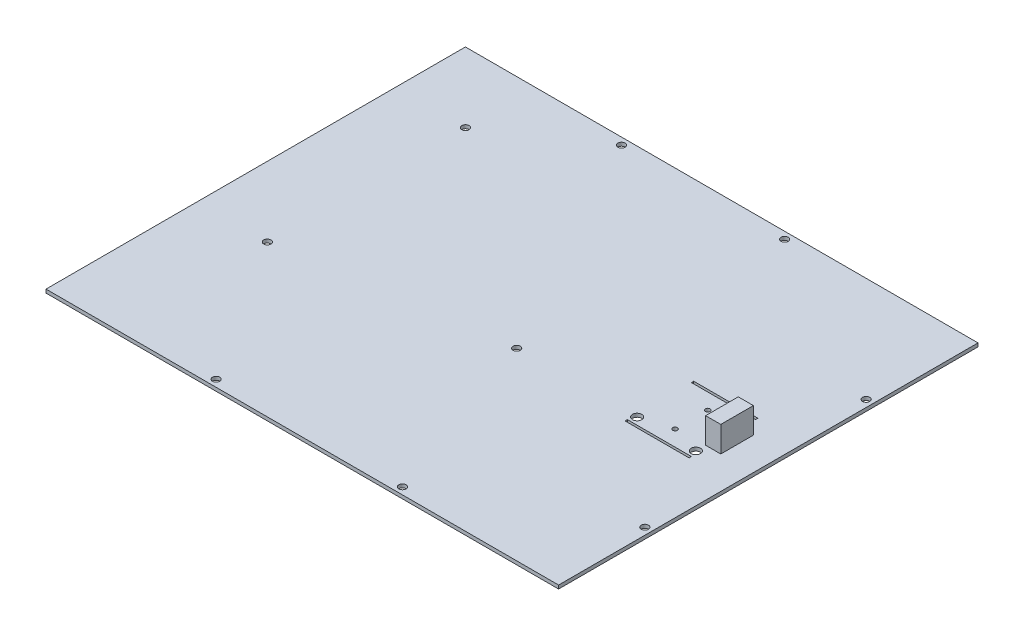
ISO-10303-21;
HEADER;
FILE_DESCRIPTION(('STEP AP214'),'2;1');
FILE_NAME('part.step','',(''),(''),'','','');
FILE_SCHEMA(('AUTOMOTIVE_DESIGN { 1 0 10303 214 1 1 1 1 }'));
ENDSEC;
DATA;
#1=APPLICATION_CONTEXT('core data for automotive mechanical design processes');
#2=APPLICATION_PROTOCOL_DEFINITION('international standard','automotive_design',2000,#1);
#3=PRODUCT_CONTEXT('',#1,'mechanical');
#4=PRODUCT('Part','Part','',(#3));
#5=PRODUCT_RELATED_PRODUCT_CATEGORY('part','',(#4));
#6=PRODUCT_DEFINITION_FORMATION('','',#4);
#7=PRODUCT_DEFINITION_CONTEXT('part definition',#1,'design');
#8=PRODUCT_DEFINITION('design','',#6,#7);
#9=PRODUCT_DEFINITION_SHAPE('','',#8);
#10=(LENGTH_UNIT() NAMED_UNIT(*) SI_UNIT(.MILLI.,.METRE.));
#11=(NAMED_UNIT(*) PLANE_ANGLE_UNIT() SI_UNIT($,.RADIAN.));
#12=(NAMED_UNIT(*) SI_UNIT($,.STERADIAN.) SOLID_ANGLE_UNIT());
#13=UNCERTAINTY_MEASURE_WITH_UNIT(LENGTH_MEASURE(1.E-05),#10,'distance_accuracy_value','');
#14=(GEOMETRIC_REPRESENTATION_CONTEXT(3) GLOBAL_UNCERTAINTY_ASSIGNED_CONTEXT((#13)) GLOBAL_UNIT_ASSIGNED_CONTEXT((#10,
#11,#12)) REPRESENTATION_CONTEXT('',''));
#15=CARTESIAN_POINT('',(0.,0.,0.));
#16=DIRECTION('',(0.,0.,1.));
#17=DIRECTION('',(1.,0.,0.));
#18=AXIS2_PLACEMENT_3D('',#15,#16,#17);
#19=CARTESIAN_POINT('',(0.,1.5,0.));
#20=DIRECTION('',(0.,-1.,0.));
#21=DIRECTION('',(0.,0.,-1.));
#22=AXIS2_PLACEMENT_3D('',#19,#20,#21);
#23=PLANE('',#22);
#24=CARTESIAN_POINT('',(123.,1.5,-79.));
#25=DIRECTION('',(0.,1.,0.));
#26=DIRECTION('',(0.,0.,1.));
#27=AXIS2_PLACEMENT_3D('',#24,#25,#26);
#28=CIRCLE('',#27,1.54999999999999);
#29=CARTESIAN_POINT('',(123.,1.5,-77.45));
#30=VERTEX_POINT('',#29);
#31=EDGE_CURVE('E267',#30,#30,#28,.T.);
#32=ORIENTED_EDGE('',*,*,#31,.F.);
#33=EDGE_LOOP('',(#32));
#34=FACE_BOUND('',#33,.T.);
#35=CARTESIAN_POINT('',(217.,1.5,-135.));
#36=DIRECTION('',(0.,1.,0.));
#37=DIRECTION('',(0.,0.,1.));
#38=AXIS2_PLACEMENT_3D('',#35,#36,#37);
#39=CIRCLE('',#38,1.54999999999999);
#40=CARTESIAN_POINT('',(217.,1.5,-133.45));
#41=VERTEX_POINT('',#40);
#42=EDGE_CURVE('E273',#41,#41,#39,.T.);
#43=ORIENTED_EDGE('',*,*,#42,.F.);
#44=EDGE_LOOP('',(#43));
#45=FACE_BOUND('',#44,.T.);
#46=CARTESIAN_POINT('',(150.,1.5,-3.));
#47=DIRECTION('',(0.,1.,0.));
#48=DIRECTION('',(0.,0.,1.));
#49=AXIS2_PLACEMENT_3D('',#46,#47,#48);
#50=CIRCLE('',#49,1.54999999999999);
#51=CARTESIAN_POINT('',(150.,1.5,-1.45000000000001));
#52=VERTEX_POINT('',#51);
#53=EDGE_CURVE('E279',#52,#52,#50,.T.);
#54=ORIENTED_EDGE('',*,*,#53,.F.);
#55=EDGE_LOOP('',(#54));
#56=FACE_BOUND('',#55,.T.);
#57=CARTESIAN_POINT('',(70.,1.5,-3.));
#58=DIRECTION('',(0.,1.,0.));
#59=DIRECTION('',(0.,0.,1.));
#60=AXIS2_PLACEMENT_3D('',#57,#58,#59);
#61=CIRCLE('',#60,1.54999999999999);
#62=CARTESIAN_POINT('',(70.,1.5,-1.45000000000001));
#63=VERTEX_POINT('',#62);
#64=EDGE_CURVE('E285',#63,#63,#61,.T.);
#65=ORIENTED_EDGE('',*,*,#64,.F.);
#66=EDGE_LOOP('',(#65));
#67=FACE_BOUND('',#66,.T.);
#68=CARTESIAN_POINT('',(217.,1.5,-40.));
#69=DIRECTION('',(0.,1.,0.));
#70=DIRECTION('',(0.,0.,1.));
#71=AXIS2_PLACEMENT_3D('',#68,#69,#70);
#72=CIRCLE('',#71,1.54999999999999);
#73=CARTESIAN_POINT('',(217.,1.5,-38.45));
#74=VERTEX_POINT('',#73);
#75=EDGE_CURVE('E291',#74,#74,#72,.T.);
#76=ORIENTED_EDGE('',*,*,#75,.F.);
#77=EDGE_LOOP('',(#76));
#78=FACE_BOUND('',#77,.T.);
#79=CARTESIAN_POINT('',(30.,1.5,-65.));
#80=DIRECTION('',(0.,1.,0.));
#81=DIRECTION('',(0.,0.,1.));
#82=AXIS2_PLACEMENT_3D('',#79,#80,#81);
#83=CIRCLE('',#82,1.55);
#84=CARTESIAN_POINT('',(30.,1.5,-63.45));
#85=VERTEX_POINT('',#84);
#86=EDGE_CURVE('E297',#85,#85,#83,.T.);
#87=ORIENTED_EDGE('',*,*,#86,.F.);
#88=EDGE_LOOP('',(#87));
#89=FACE_BOUND('',#88,.T.);
#90=CARTESIAN_POINT('',(30.,1.5,-150.));
#91=DIRECTION('',(0.,1.,0.));
#92=DIRECTION('',(0.,0.,1.));
#93=AXIS2_PLACEMENT_3D('',#90,#91,#92);
#94=CIRCLE('',#93,1.54999999999999);
#95=CARTESIAN_POINT('',(30.,1.5,-148.45));
#96=VERTEX_POINT('',#95);
#97=EDGE_CURVE('E303',#96,#96,#94,.T.);
#98=ORIENTED_EDGE('',*,*,#97,.F.);
#99=EDGE_LOOP('',(#98));
#100=FACE_BOUND('',#99,.T.);
#101=CARTESIAN_POINT('',(140.,1.5,-177.));
#102=DIRECTION('',(0.,1.,0.));
#103=DIRECTION('',(0.,0.,1.));
#104=AXIS2_PLACEMENT_3D('',#101,#102,#103);
#105=CIRCLE('',#104,1.54999999999999);
#106=CARTESIAN_POINT('',(140.,1.5,-175.45));
#107=VERTEX_POINT('',#106);
#108=EDGE_CURVE('E309',#107,#107,#105,.T.);
#109=ORIENTED_EDGE('',*,*,#108,.F.);
#110=EDGE_LOOP('',(#109));
#111=FACE_BOUND('',#110,.T.);
#112=CARTESIAN_POINT('',(70.,1.5,-177.));
#113=DIRECTION('',(0.,1.,0.));
#114=DIRECTION('',(0.,0.,1.));
#115=AXIS2_PLACEMENT_3D('',#112,#113,#114);
#116=CIRCLE('',#115,1.54999999999999);
#117=CARTESIAN_POINT('',(70.,1.5,-175.45));
#118=VERTEX_POINT('',#117);
#119=EDGE_CURVE('E315',#118,#118,#116,.T.);
#120=ORIENTED_EDGE('',*,*,#119,.F.);
#121=EDGE_LOOP('',(#120));
#122=FACE_BOUND('',#121,.T.);
#123=DIRECTION('',(0.,0.,1.));
#124=VECTOR('',#123,1.);
#125=CARTESIAN_POINT('',(0.,1.5,0.));
#126=LINE('',#125,#124);
#127=CARTESIAN_POINT('',(0.,1.5,-180.));
#128=VERTEX_POINT('',#127);
#129=CARTESIAN_POINT('',(0.,1.5,0.));
#130=VERTEX_POINT('',#129);
#131=EDGE_CURVE('E321',#128,#130,#126,.T.);
#132=ORIENTED_EDGE('',*,*,#131,.T.);
#133=DIRECTION('',(1.,0.,0.));
#134=VECTOR('',#133,1.);
#135=CARTESIAN_POINT('',(0.,1.5,0.));
#136=LINE('',#135,#134);
#137=CARTESIAN_POINT('',(220.,1.5,0.));
#138=VERTEX_POINT('',#137);
#139=EDGE_CURVE('E324',#130,#138,#136,.T.);
#140=ORIENTED_EDGE('',*,*,#139,.T.);
#141=DIRECTION('',(0.,0.,-1.));
#142=VECTOR('',#141,1.);
#143=CARTESIAN_POINT('',(220.,1.5,0.));
#144=LINE('',#143,#142);
#145=CARTESIAN_POINT('',(220.,1.5,-180.));
#146=VERTEX_POINT('',#145);
#147=EDGE_CURVE('E327',#138,#146,#144,.T.);
#148=ORIENTED_EDGE('',*,*,#147,.T.);
#149=DIRECTION('',(-1.,0.,0.));
#150=VECTOR('',#149,1.);
#151=CARTESIAN_POINT('',(0.,1.5,-180.));
#152=LINE('',#151,#150);
#153=EDGE_CURVE('E329',#146,#128,#152,.T.);
#154=ORIENTED_EDGE('',*,*,#153,.T.);
#155=EDGE_LOOP('',(#132,#140,#148,#154));
#156=FACE_BOUND('',#155,.T.);
#157=DIRECTION('',(0.,0.,-1.));
#158=VECTOR('',#157,1.);
#159=CARTESIAN_POINT('',(200.75,1.5,-75.25));
#160=LINE('',#159,#158);
#161=CARTESIAN_POINT('',(200.75,1.5,-75.25));
#162=VERTEX_POINT('',#161);
#163=CARTESIAN_POINT('',(200.75,1.5,-76.25));
#164=VERTEX_POINT('',#163);
#165=EDGE_CURVE('E250',#162,#164,#160,.T.);
#166=ORIENTED_EDGE('',*,*,#165,.F.);
#167=DIRECTION('',(1.,0.,0.));
#168=VECTOR('',#167,1.);
#169=CARTESIAN_POINT('',(173.25,1.5,-75.25));
#170=LINE('',#169,#168);
#171=CARTESIAN_POINT('',(173.25,1.5,-75.25));
#172=VERTEX_POINT('',#171);
#173=EDGE_CURVE('E228',#172,#162,#170,.T.);
#174=ORIENTED_EDGE('',*,*,#173,.F.);
#175=DIRECTION('',(0.,0.,1.));
#176=VECTOR('',#175,1.);
#177=CARTESIAN_POINT('',(173.25,1.5,-75.25));
#178=LINE('',#177,#176);
#179=CARTESIAN_POINT('',(173.25,1.5,-76.25));
#180=VERTEX_POINT('',#179);
#181=EDGE_CURVE('E239',#180,#172,#178,.T.);
#182=ORIENTED_EDGE('',*,*,#181,.F.);
#183=DIRECTION('',(-1.,0.,0.));
#184=VECTOR('',#183,1.);
#185=CARTESIAN_POINT('',(173.25,1.5,-76.25));
#186=LINE('',#185,#184);
#187=EDGE_CURVE('E253',#164,#180,#186,.T.);
#188=ORIENTED_EDGE('',*,*,#187,.F.);
#189=EDGE_LOOP('',(#166,#174,#182,#188));
#190=FACE_BOUND('',#189,.T.);
#191=DIRECTION('',(0.,0.,1.));
#192=VECTOR('',#191,1.);
#193=CARTESIAN_POINT('',(173.25,1.5,-104.75));
#194=LINE('',#193,#192);
#195=CARTESIAN_POINT('',(173.25,1.5,-104.75));
#196=VERTEX_POINT('',#195);
#197=CARTESIAN_POINT('',(173.25,1.5,-103.75));
#198=VERTEX_POINT('',#197);
#199=EDGE_CURVE('E218',#196,#198,#194,.T.);
#200=ORIENTED_EDGE('',*,*,#199,.F.);
#201=DIRECTION('',(-1.,0.,0.));
#202=VECTOR('',#201,1.);
#203=CARTESIAN_POINT('',(173.25,1.5,-104.75));
#204=LINE('',#203,#202);
#205=CARTESIAN_POINT('',(200.75,1.5,-104.75));
#206=VERTEX_POINT('',#205);
#207=EDGE_CURVE('E200',#206,#196,#204,.T.);
#208=ORIENTED_EDGE('',*,*,#207,.F.);
#209=DIRECTION('',(0.,0.,-1.));
#210=VECTOR('',#209,1.);
#211=CARTESIAN_POINT('',(200.75,1.5,-104.75));
#212=LINE('',#211,#210);
#213=CARTESIAN_POINT('',(200.75,1.5,-103.75));
#214=VERTEX_POINT('',#213);
#215=EDGE_CURVE('E207',#214,#206,#212,.T.);
#216=ORIENTED_EDGE('',*,*,#215,.F.);
#217=DIRECTION('',(1.,0.,0.));
#218=VECTOR('',#217,1.);
#219=CARTESIAN_POINT('',(173.25,1.5,-103.75));
#220=LINE('',#219,#218);
#221=EDGE_CURVE('E221',#198,#214,#220,.T.);
#222=ORIENTED_EDGE('',*,*,#221,.F.);
#223=EDGE_LOOP('',(#200,#208,#216,#222));
#224=FACE_BOUND('',#223,.T.);
#225=CARTESIAN_POINT('',(187.,1.5,-83.));
#226=DIRECTION('',(0.,1.,0.));
#227=DIRECTION('',(0.,0.,1.));
#228=AXIS2_PLACEMENT_3D('',#225,#226,#227);
#229=CIRCLE('',#228,0.999999999999998);
#230=CARTESIAN_POINT('',(187.,1.5,-82.));
#231=VERTEX_POINT('',#230);
#232=EDGE_CURVE('E194',#231,#231,#229,.T.);
#233=ORIENTED_EDGE('',*,*,#232,.F.);
#234=EDGE_LOOP('',(#233));
#235=FACE_BOUND('',#234,.T.);
#236=CARTESIAN_POINT('',(187.,1.5,-97.));
#237=DIRECTION('',(0.,1.,0.));
#238=DIRECTION('',(0.,0.,-1.));
#239=AXIS2_PLACEMENT_3D('',#236,#237,#238);
#240=CIRCLE('',#239,0.999999999999998);
#241=CARTESIAN_POINT('',(187.,1.5,-98.));
#242=VERTEX_POINT('',#241);
#243=EDGE_CURVE('E188',#242,#242,#240,.T.);
#244=ORIENTED_EDGE('',*,*,#243,.F.);
#245=EDGE_LOOP('',(#244));
#246=FACE_BOUND('',#245,.T.);
#247=CARTESIAN_POINT('',(174.4,1.5,-79.3));
#248=DIRECTION('',(0.,1.,0.));
#249=DIRECTION('',(0.,0.,1.));
#250=AXIS2_PLACEMENT_3D('',#247,#248,#249);
#251=CIRCLE('',#250,2.);
#252=CARTESIAN_POINT('',(174.4,1.5,-77.3));
#253=VERTEX_POINT('',#252);
#254=EDGE_CURVE('E182',#253,#253,#251,.T.);
#255=ORIENTED_EDGE('',*,*,#254,.F.);
#256=EDGE_LOOP('',(#255));
#257=FACE_BOUND('',#256,.T.);
#258=CARTESIAN_POINT('',(199.6,1.5,-79.3));
#259=DIRECTION('',(0.,1.,0.));
#260=DIRECTION('',(0.,0.,1.));
#261=AXIS2_PLACEMENT_3D('',#258,#259,#260);
#262=CIRCLE('',#261,2.);
#263=CARTESIAN_POINT('',(199.6,1.5,-77.3));
#264=VERTEX_POINT('',#263);
#265=EDGE_CURVE('E177',#264,#264,#262,.T.);
#266=ORIENTED_EDGE('',*,*,#265,.F.);
#267=EDGE_LOOP('',(#266));
#268=FACE_BOUND('',#267,.T.);
#269=CARTESIAN_POINT('',(199.6,1.5,-100.7));
#270=DIRECTION('',(0.,1.,0.));
#271=DIRECTION('',(0.,0.,-1.));
#272=AXIS2_PLACEMENT_3D('',#269,#270,#271);
#273=CIRCLE('',#272,2.);
#274=CARTESIAN_POINT('',(199.6,1.5,-102.7));
#275=VERTEX_POINT('',#274);
#276=EDGE_CURVE('E167',#275,#275,#273,.T.);
#277=ORIENTED_EDGE('',*,*,#276,.F.);
#278=EDGE_LOOP('',(#277));
#279=FACE_BOUND('',#278,.T.);
#280=DIRECTION('',(1.,0.,0.));
#281=VECTOR('',#280,1.);
#282=CARTESIAN_POINT('',(199.6,1.5,-83.5));
#283=LINE('',#282,#281);
#284=CARTESIAN_POINT('',(199.6,1.5,-83.5));
#285=VERTEX_POINT('',#284);
#286=CARTESIAN_POINT('',(206.1,1.5,-83.5));
#287=VERTEX_POINT('',#286);
#288=EDGE_CURVE('E166',#285,#287,#283,.T.);
#289=ORIENTED_EDGE('',*,*,#288,.F.);
#290=DIRECTION('',(0.,0.,1.));
#291=VECTOR('',#290,1.);
#292=CARTESIAN_POINT('',(199.6,1.5,-83.5));
#293=LINE('',#292,#291);
#294=CARTESIAN_POINT('',(199.6,1.5,-97.5));
#295=VERTEX_POINT('',#294);
#296=EDGE_CURVE('E163',#295,#285,#293,.T.);
#297=ORIENTED_EDGE('',*,*,#296,.F.);
#298=DIRECTION('',(-1.,0.,0.));
#299=VECTOR('',#298,1.);
#300=CARTESIAN_POINT('',(199.6,1.5,-97.5));
#301=LINE('',#300,#299);
#302=CARTESIAN_POINT('',(206.1,1.5,-97.5));
#303=VERTEX_POINT('',#302);
#304=EDGE_CURVE('E53',#303,#295,#301,.T.);
#305=ORIENTED_EDGE('',*,*,#304,.F.);
#306=DIRECTION('',(0.,0.,-1.));
#307=VECTOR('',#306,1.);
#308=CARTESIAN_POINT('',(206.1,1.5,-83.5));
#309=LINE('',#308,#307);
#310=EDGE_CURVE('E48',#287,#303,#309,.T.);
#311=ORIENTED_EDGE('',*,*,#310,.F.);
#312=EDGE_LOOP('',(#289,#297,#305,#311));
#313=FACE_BOUND('',#312,.T.);
#314=ADVANCED_FACE('F33',(#34,#45,#56,#67,#78,#89,#100,#111,#122,#156,#190,#224,#235,#246,#257,
#268,#279,#313),#23,.F.);
#315=CARTESIAN_POINT('',(0.,0.,0.));
#316=DIRECTION('',(0.,-1.,0.));
#317=DIRECTION('',(0.,0.,-1.));
#318=AXIS2_PLACEMENT_3D('',#315,#316,#317);
#319=PLANE('',#318);
#320=CARTESIAN_POINT('',(199.6,0.,-100.7));
#321=DIRECTION('',(0.,1.,0.));
#322=DIRECTION('',(0.,0.,-1.));
#323=AXIS2_PLACEMENT_3D('',#320,#321,#322);
#324=CIRCLE('',#323,2.);
#325=CARTESIAN_POINT('',(199.6,0.,-102.7));
#326=VERTEX_POINT('',#325);
#327=EDGE_CURVE('E170',#326,#326,#324,.T.);
#328=ORIENTED_EDGE('',*,*,#327,.T.);
#329=EDGE_LOOP('',(#328));
#330=FACE_BOUND('',#329,.T.);
#331=CARTESIAN_POINT('',(199.6,0.,-79.3));
#332=DIRECTION('',(0.,1.,0.));
#333=DIRECTION('',(0.,0.,1.));
#334=AXIS2_PLACEMENT_3D('',#331,#332,#333);
#335=CIRCLE('',#334,2.);
#336=CARTESIAN_POINT('',(199.6,0.,-77.3));
#337=VERTEX_POINT('',#336);
#338=EDGE_CURVE('E179',#337,#337,#335,.T.);
#339=ORIENTED_EDGE('',*,*,#338,.T.);
#340=EDGE_LOOP('',(#339));
#341=FACE_BOUND('',#340,.T.);
#342=CARTESIAN_POINT('',(174.4,0.,-79.3));
#343=DIRECTION('',(0.,1.,0.));
#344=DIRECTION('',(0.,0.,1.));
#345=AXIS2_PLACEMENT_3D('',#342,#343,#344);
#346=CIRCLE('',#345,2.);
#347=CARTESIAN_POINT('',(174.4,0.,-77.3));
#348=VERTEX_POINT('',#347);
#349=EDGE_CURVE('E185',#348,#348,#346,.T.);
#350=ORIENTED_EDGE('',*,*,#349,.T.);
#351=EDGE_LOOP('',(#350));
#352=FACE_BOUND('',#351,.T.);
#353=CARTESIAN_POINT('',(187.,0.,-97.));
#354=DIRECTION('',(0.,1.,0.));
#355=DIRECTION('',(0.,0.,-1.));
#356=AXIS2_PLACEMENT_3D('',#353,#354,#355);
#357=CIRCLE('',#356,0.999999999999998);
#358=CARTESIAN_POINT('',(187.,0.,-98.));
#359=VERTEX_POINT('',#358);
#360=EDGE_CURVE('E191',#359,#359,#357,.T.);
#361=ORIENTED_EDGE('',*,*,#360,.T.);
#362=EDGE_LOOP('',(#361));
#363=FACE_BOUND('',#362,.T.);
#364=CARTESIAN_POINT('',(187.,0.,-83.));
#365=DIRECTION('',(0.,1.,0.));
#366=DIRECTION('',(0.,0.,1.));
#367=AXIS2_PLACEMENT_3D('',#364,#365,#366);
#368=CIRCLE('',#367,0.999999999999998);
#369=CARTESIAN_POINT('',(187.,0.,-82.));
#370=VERTEX_POINT('',#369);
#371=EDGE_CURVE('E197',#370,#370,#368,.T.);
#372=ORIENTED_EDGE('',*,*,#371,.T.);
#373=EDGE_LOOP('',(#372));
#374=FACE_BOUND('',#373,.T.);
#375=DIRECTION('',(-1.,0.,0.));
#376=VECTOR('',#375,1.);
#377=CARTESIAN_POINT('',(173.25,0.,-104.75));
#378=LINE('',#377,#376);
#379=CARTESIAN_POINT('',(200.75,0.,-104.75));
#380=VERTEX_POINT('',#379);
#381=CARTESIAN_POINT('',(173.25,0.,-104.75));
#382=VERTEX_POINT('',#381);
#383=EDGE_CURVE('E203',#380,#382,#378,.T.);
#384=ORIENTED_EDGE('',*,*,#383,.T.);
#385=DIRECTION('',(0.,0.,1.));
#386=VECTOR('',#385,1.);
#387=CARTESIAN_POINT('',(173.25,0.,-104.75));
#388=LINE('',#387,#386);
#389=CARTESIAN_POINT('',(173.25,0.,-103.75));
#390=VERTEX_POINT('',#389);
#391=EDGE_CURVE('E206',#382,#390,#388,.T.);
#392=ORIENTED_EDGE('',*,*,#391,.T.);
#393=DIRECTION('',(1.,0.,0.));
#394=VECTOR('',#393,1.);
#395=CARTESIAN_POINT('',(173.25,0.,-103.75));
#396=LINE('',#395,#394);
#397=CARTESIAN_POINT('',(200.75,0.,-103.75));
#398=VERTEX_POINT('',#397);
#399=EDGE_CURVE('E210',#390,#398,#396,.T.);
#400=ORIENTED_EDGE('',*,*,#399,.T.);
#401=DIRECTION('',(0.,0.,-1.));
#402=VECTOR('',#401,1.);
#403=CARTESIAN_POINT('',(200.75,0.,-104.75));
#404=LINE('',#403,#402);
#405=EDGE_CURVE('E213',#398,#380,#404,.T.);
#406=ORIENTED_EDGE('',*,*,#405,.T.);
#407=EDGE_LOOP('',(#384,#392,#400,#406));
#408=FACE_BOUND('',#407,.T.);
#409=DIRECTION('',(1.,0.,0.));
#410=VECTOR('',#409,1.);
#411=CARTESIAN_POINT('',(173.25,0.,-75.25));
#412=LINE('',#411,#410);
#413=CARTESIAN_POINT('',(173.25,0.,-75.25));
#414=VERTEX_POINT('',#413);
#415=CARTESIAN_POINT('',(200.75,0.,-75.25));
#416=VERTEX_POINT('',#415);
#417=EDGE_CURVE('E235',#414,#416,#412,.T.);
#418=ORIENTED_EDGE('',*,*,#417,.T.);
#419=DIRECTION('',(0.,0.,-1.));
#420=VECTOR('',#419,1.);
#421=CARTESIAN_POINT('',(200.75,0.,-75.25));
#422=LINE('',#421,#420);
#423=CARTESIAN_POINT('',(200.75,0.,-76.25));
#424=VERTEX_POINT('',#423);
#425=EDGE_CURVE('E238',#416,#424,#422,.T.);
#426=ORIENTED_EDGE('',*,*,#425,.T.);
#427=DIRECTION('',(-1.,0.,0.));
#428=VECTOR('',#427,1.);
#429=CARTESIAN_POINT('',(173.25,0.,-76.25));
#430=LINE('',#429,#428);
#431=CARTESIAN_POINT('',(173.25,0.,-76.25));
#432=VERTEX_POINT('',#431);
#433=EDGE_CURVE('E242',#424,#432,#430,.T.);
#434=ORIENTED_EDGE('',*,*,#433,.T.);
#435=DIRECTION('',(0.,0.,1.));
#436=VECTOR('',#435,1.);
#437=CARTESIAN_POINT('',(173.25,0.,-75.25));
#438=LINE('',#437,#436);
#439=EDGE_CURVE('E245',#432,#414,#438,.T.);
#440=ORIENTED_EDGE('',*,*,#439,.T.);
#441=EDGE_LOOP('',(#418,#426,#434,#440));
#442=FACE_BOUND('',#441,.T.);
#443=CARTESIAN_POINT('',(217.,0.,-135.));
#444=DIRECTION('',(0.,1.,0.));
#445=DIRECTION('',(0.,0.,1.));
#446=AXIS2_PLACEMENT_3D('',#443,#444,#445);
#447=CIRCLE('',#446,1.54999999999999);
#448=CARTESIAN_POINT('',(217.,0.,-133.45));
#449=VERTEX_POINT('',#448);
#450=EDGE_CURVE('E270',#449,#449,#447,.T.);
#451=ORIENTED_EDGE('',*,*,#450,.T.);
#452=EDGE_LOOP('',(#451));
#453=FACE_BOUND('',#452,.T.);
#454=CARTESIAN_POINT('',(70.,0.,-3.));
#455=DIRECTION('',(0.,1.,0.));
#456=DIRECTION('',(0.,0.,1.));
#457=AXIS2_PLACEMENT_3D('',#454,#455,#456);
#458=CIRCLE('',#457,1.54999999999999);
#459=CARTESIAN_POINT('',(70.,0.,-1.45000000000001));
#460=VERTEX_POINT('',#459);
#461=EDGE_CURVE('E282',#460,#460,#458,.T.);
#462=ORIENTED_EDGE('',*,*,#461,.T.);
#463=EDGE_LOOP('',(#462));
#464=FACE_BOUND('',#463,.T.);
#465=CARTESIAN_POINT('',(30.,0.,-65.));
#466=DIRECTION('',(0.,1.,0.));
#467=DIRECTION('',(0.,0.,1.));
#468=AXIS2_PLACEMENT_3D('',#465,#466,#467);
#469=CIRCLE('',#468,1.55);
#470=CARTESIAN_POINT('',(30.,0.,-63.45));
#471=VERTEX_POINT('',#470);
#472=EDGE_CURVE('E294',#471,#471,#469,.T.);
#473=ORIENTED_EDGE('',*,*,#472,.T.);
#474=EDGE_LOOP('',(#473));
#475=FACE_BOUND('',#474,.T.);
#476=CARTESIAN_POINT('',(140.,0.,-177.));
#477=DIRECTION('',(0.,1.,0.));
#478=DIRECTION('',(0.,0.,1.));
#479=AXIS2_PLACEMENT_3D('',#476,#477,#478);
#480=CIRCLE('',#479,1.54999999999999);
#481=CARTESIAN_POINT('',(140.,0.,-175.45));
#482=VERTEX_POINT('',#481);
#483=EDGE_CURVE('E306',#482,#482,#480,.T.);
#484=ORIENTED_EDGE('',*,*,#483,.T.);
#485=EDGE_LOOP('',(#484));
#486=FACE_BOUND('',#485,.T.);
#487=DIRECTION('',(0.,0.,1.));
#488=VECTOR('',#487,1.);
#489=CARTESIAN_POINT('',(0.,0.,0.));
#490=LINE('',#489,#488);
#491=CARTESIAN_POINT('',(0.,0.,-180.));
#492=VERTEX_POINT('',#491);
#493=CARTESIAN_POINT('',(0.,0.,0.));
#494=VERTEX_POINT('',#493);
#495=EDGE_CURVE('E318',#492,#494,#490,.T.);
#496=ORIENTED_EDGE('',*,*,#495,.F.);
#497=DIRECTION('',(-1.,0.,0.));
#498=VECTOR('',#497,1.);
#499=CARTESIAN_POINT('',(0.,0.,-180.));
#500=LINE('',#499,#498);
#501=CARTESIAN_POINT('',(220.,0.,-180.));
#502=VERTEX_POINT('',#501);
#503=EDGE_CURVE('E325',#502,#492,#500,.T.);
#504=ORIENTED_EDGE('',*,*,#503,.F.);
#505=DIRECTION('',(0.,0.,-1.));
#506=VECTOR('',#505,1.);
#507=CARTESIAN_POINT('',(220.,0.,0.));
#508=LINE('',#507,#506);
#509=CARTESIAN_POINT('',(220.,0.,0.));
#510=VERTEX_POINT('',#509);
#511=EDGE_CURVE('E336',#510,#502,#508,.T.);
#512=ORIENTED_EDGE('',*,*,#511,.F.);
#513=DIRECTION('',(1.,0.,0.));
#514=VECTOR('',#513,1.);
#515=CARTESIAN_POINT('',(0.,0.,0.));
#516=LINE('',#515,#514);
#517=EDGE_CURVE('E334',#494,#510,#516,.T.);
#518=ORIENTED_EDGE('',*,*,#517,.F.);
#519=EDGE_LOOP('',(#496,#504,#512,#518));
#520=FACE_BOUND('',#519,.T.);
#521=CARTESIAN_POINT('',(70.,0.,-177.));
#522=DIRECTION('',(0.,1.,0.));
#523=DIRECTION('',(0.,0.,1.));
#524=AXIS2_PLACEMENT_3D('',#521,#522,#523);
#525=CIRCLE('',#524,1.54999999999999);
#526=CARTESIAN_POINT('',(70.,0.,-175.45));
#527=VERTEX_POINT('',#526);
#528=EDGE_CURVE('E312',#527,#527,#525,.T.);
#529=ORIENTED_EDGE('',*,*,#528,.T.);
#530=EDGE_LOOP('',(#529));
#531=FACE_BOUND('',#530,.T.);
#532=CARTESIAN_POINT('',(30.,0.,-150.));
#533=DIRECTION('',(0.,1.,0.));
#534=DIRECTION('',(0.,0.,1.));
#535=AXIS2_PLACEMENT_3D('',#532,#533,#534);
#536=CIRCLE('',#535,1.54999999999999);
#537=CARTESIAN_POINT('',(30.,0.,-148.45));
#538=VERTEX_POINT('',#537);
#539=EDGE_CURVE('E300',#538,#538,#536,.T.);
#540=ORIENTED_EDGE('',*,*,#539,.T.);
#541=EDGE_LOOP('',(#540));
#542=FACE_BOUND('',#541,.T.);
#543=CARTESIAN_POINT('',(217.,0.,-40.));
#544=DIRECTION('',(0.,1.,0.));
#545=DIRECTION('',(0.,0.,1.));
#546=AXIS2_PLACEMENT_3D('',#543,#544,#545);
#547=CIRCLE('',#546,1.54999999999999);
#548=CARTESIAN_POINT('',(217.,0.,-38.45));
#549=VERTEX_POINT('',#548);
#550=EDGE_CURVE('E288',#549,#549,#547,.T.);
#551=ORIENTED_EDGE('',*,*,#550,.T.);
#552=EDGE_LOOP('',(#551));
#553=FACE_BOUND('',#552,.T.);
#554=CARTESIAN_POINT('',(150.,0.,-3.));
#555=DIRECTION('',(0.,1.,0.));
#556=DIRECTION('',(0.,0.,1.));
#557=AXIS2_PLACEMENT_3D('',#554,#555,#556);
#558=CIRCLE('',#557,1.54999999999999);
#559=CARTESIAN_POINT('',(150.,0.,-1.45000000000001));
#560=VERTEX_POINT('',#559);
#561=EDGE_CURVE('E276',#560,#560,#558,.T.);
#562=ORIENTED_EDGE('',*,*,#561,.T.);
#563=EDGE_LOOP('',(#562));
#564=FACE_BOUND('',#563,.T.);
#565=CARTESIAN_POINT('',(123.,0.,-79.));
#566=DIRECTION('',(0.,1.,0.));
#567=DIRECTION('',(0.,0.,1.));
#568=AXIS2_PLACEMENT_3D('',#565,#566,#567);
#569=CIRCLE('',#568,1.54999999999999);
#570=CARTESIAN_POINT('',(123.,0.,-77.45));
#571=VERTEX_POINT('',#570);
#572=EDGE_CURVE('E260',#571,#571,#569,.T.);
#573=ORIENTED_EDGE('',*,*,#572,.T.);
#574=EDGE_LOOP('',(#573));
#575=FACE_BOUND('',#574,.T.);
#576=ADVANCED_FACE('F354',(#330,#341,#352,#363,#374,#408,#442,#453,#464,#475,#486,#520,#531,
#542,#553,#564,#575),#319,.T.);
#577=CARTESIAN_POINT('',(0.,1.5,0.));
#578=DIRECTION('',(1.,0.,0.));
#579=DIRECTION('',(0.,0.,-1.));
#580=AXIS2_PLACEMENT_3D('',#577,#578,#579);
#581=PLANE('',#580);
#582=ORIENTED_EDGE('',*,*,#495,.T.);
#583=DIRECTION('',(0.,-1.,0.));
#584=VECTOR('',#583,1.);
#585=CARTESIAN_POINT('',(0.,1.5,0.));
#586=LINE('',#585,#584);
#587=EDGE_CURVE('E11',#130,#494,#586,.T.);
#588=ORIENTED_EDGE('',*,*,#587,.F.);
#589=ORIENTED_EDGE('',*,*,#131,.F.);
#590=DIRECTION('',(0.,-1.,0.));
#591=VECTOR('',#590,1.);
#592=CARTESIAN_POINT('',(0.,1.5,-180.));
#593=LINE('',#592,#591);
#594=EDGE_CURVE('E331',#128,#492,#593,.T.);
#595=ORIENTED_EDGE('',*,*,#594,.T.);
#596=EDGE_LOOP('',(#582,#588,#589,#595));
#597=FACE_BOUND('',#596,.T.);
#598=ADVANCED_FACE('F35',(#597),#581,.F.);
#599=CARTESIAN_POINT('',(0.,1.5,0.));
#600=DIRECTION('',(0.,0.,-1.));
#601=DIRECTION('',(-1.,0.,0.));
#602=AXIS2_PLACEMENT_3D('',#599,#600,#601);
#603=PLANE('',#602);
#604=ORIENTED_EDGE('',*,*,#517,.T.);
#605=DIRECTION('',(0.,-1.,0.));
#606=VECTOR('',#605,1.);
#607=CARTESIAN_POINT('',(220.,1.5,0.));
#608=LINE('',#607,#606);
#609=EDGE_CURVE('E41',#138,#510,#608,.T.);
#610=ORIENTED_EDGE('',*,*,#609,.F.);
#611=ORIENTED_EDGE('',*,*,#139,.F.);
#612=ORIENTED_EDGE('',*,*,#587,.T.);
#613=EDGE_LOOP('',(#604,#610,#611,#612));
#614=FACE_BOUND('',#613,.T.);
#615=ADVANCED_FACE('F365',(#614),#603,.F.);
#616=CARTESIAN_POINT('',(220.,1.5,0.));
#617=DIRECTION('',(-1.,0.,0.));
#618=DIRECTION('',(0.,0.,1.));
#619=AXIS2_PLACEMENT_3D('',#616,#617,#618);
#620=PLANE('',#619);
#621=ORIENTED_EDGE('',*,*,#511,.T.);
#622=DIRECTION('',(0.,-1.,0.));
#623=VECTOR('',#622,1.);
#624=CARTESIAN_POINT('',(220.,1.5,-180.));
#625=LINE('',#624,#623);
#626=EDGE_CURVE('E341',#146,#502,#625,.T.);
#627=ORIENTED_EDGE('',*,*,#626,.F.);
#628=ORIENTED_EDGE('',*,*,#147,.F.);
#629=ORIENTED_EDGE('',*,*,#609,.T.);
#630=EDGE_LOOP('',(#621,#627,#628,#629));
#631=FACE_BOUND('',#630,.T.);
#632=ADVANCED_FACE('F348',(#631),#620,.F.);
#633=CARTESIAN_POINT('',(0.,1.5,-180.));
#634=DIRECTION('',(0.,0.,1.));
#635=DIRECTION('',(1.,0.,0.));
#636=AXIS2_PLACEMENT_3D('',#633,#634,#635);
#637=PLANE('',#636);
#638=ORIENTED_EDGE('',*,*,#503,.T.);
#639=ORIENTED_EDGE('',*,*,#594,.F.);
#640=ORIENTED_EDGE('',*,*,#153,.F.);
#641=ORIENTED_EDGE('',*,*,#626,.T.);
#642=EDGE_LOOP('',(#638,#639,#640,#641));
#643=FACE_BOUND('',#642,.T.);
#644=ADVANCED_FACE('F358',(#643),#637,.F.);
#645=CARTESIAN_POINT('',(70.,1.5,-177.));
#646=DIRECTION('',(0.,-1.,0.));
#647=DIRECTION('',(0.,0.,-1.));
#648=AXIS2_PLACEMENT_3D('',#645,#646,#647);
#649=CYLINDRICAL_SURFACE('',#648,1.54999999999999);
#650=ORIENTED_EDGE('',*,*,#119,.T.);
#651=EDGE_LOOP('',(#650));
#652=FACE_BOUND('',#651,.T.);
#653=ORIENTED_EDGE('',*,*,#528,.F.);
#654=EDGE_LOOP('',(#653));
#655=FACE_BOUND('',#654,.T.);
#656=ADVANCED_FACE('F383',(#652,#655),#649,.F.);
#657=CARTESIAN_POINT('',(140.,1.5,-177.));
#658=DIRECTION('',(0.,-1.,0.));
#659=DIRECTION('',(0.,0.,-1.));
#660=AXIS2_PLACEMENT_3D('',#657,#658,#659);
#661=CYLINDRICAL_SURFACE('',#660,1.54999999999999);
#662=ORIENTED_EDGE('',*,*,#108,.T.);
#663=EDGE_LOOP('',(#662));
#664=FACE_BOUND('',#663,.T.);
#665=ORIENTED_EDGE('',*,*,#483,.F.);
#666=EDGE_LOOP('',(#665));
#667=FACE_BOUND('',#666,.T.);
#668=ADVANCED_FACE('F390',(#664,#667),#661,.F.);
#669=CARTESIAN_POINT('',(30.,1.5,-150.));
#670=DIRECTION('',(0.,-1.,0.));
#671=DIRECTION('',(0.,0.,-1.));
#672=AXIS2_PLACEMENT_3D('',#669,#670,#671);
#673=CYLINDRICAL_SURFACE('',#672,1.54999999999999);
#674=ORIENTED_EDGE('',*,*,#97,.T.);
#675=EDGE_LOOP('',(#674));
#676=FACE_BOUND('',#675,.T.);
#677=ORIENTED_EDGE('',*,*,#539,.F.);
#678=EDGE_LOOP('',(#677));
#679=FACE_BOUND('',#678,.T.);
#680=ADVANCED_FACE('F395',(#676,#679),#673,.F.);
#681=CARTESIAN_POINT('',(30.,1.5,-65.));
#682=DIRECTION('',(0.,-1.,0.));
#683=DIRECTION('',(0.,0.,-1.));
#684=AXIS2_PLACEMENT_3D('',#681,#682,#683);
#685=CYLINDRICAL_SURFACE('',#684,1.55);
#686=ORIENTED_EDGE('',*,*,#86,.T.);
#687=EDGE_LOOP('',(#686));
#688=FACE_BOUND('',#687,.T.);
#689=ORIENTED_EDGE('',*,*,#472,.F.);
#690=EDGE_LOOP('',(#689));
#691=FACE_BOUND('',#690,.T.);
#692=ADVANCED_FACE('F437',(#688,#691),#685,.F.);
#693=CARTESIAN_POINT('',(217.,1.5,-40.));
#694=DIRECTION('',(0.,-1.,0.));
#695=DIRECTION('',(0.,0.,-1.));
#696=AXIS2_PLACEMENT_3D('',#693,#694,#695);
#697=CYLINDRICAL_SURFACE('',#696,1.54999999999999);
#698=ORIENTED_EDGE('',*,*,#75,.T.);
#699=EDGE_LOOP('',(#698));
#700=FACE_BOUND('',#699,.T.);
#701=ORIENTED_EDGE('',*,*,#550,.F.);
#702=EDGE_LOOP('',(#701));
#703=FACE_BOUND('',#702,.T.);
#704=ADVANCED_FACE('F433',(#700,#703),#697,.F.);
#705=CARTESIAN_POINT('',(70.,1.5,-3.));
#706=DIRECTION('',(0.,-1.,0.));
#707=DIRECTION('',(0.,0.,-1.));
#708=AXIS2_PLACEMENT_3D('',#705,#706,#707);
#709=CYLINDRICAL_SURFACE('',#708,1.54999999999999);
#710=ORIENTED_EDGE('',*,*,#64,.T.);
#711=EDGE_LOOP('',(#710));
#712=FACE_BOUND('',#711,.T.);
#713=ORIENTED_EDGE('',*,*,#461,.F.);
#714=EDGE_LOOP('',(#713));
#715=FACE_BOUND('',#714,.T.);
#716=ADVANCED_FACE('F429',(#712,#715),#709,.F.);
#717=CARTESIAN_POINT('',(150.,1.5,-3.));
#718=DIRECTION('',(0.,-1.,0.));
#719=DIRECTION('',(0.,0.,-1.));
#720=AXIS2_PLACEMENT_3D('',#717,#718,#719);
#721=CYLINDRICAL_SURFACE('',#720,1.54999999999999);
#722=ORIENTED_EDGE('',*,*,#53,.T.);
#723=EDGE_LOOP('',(#722));
#724=FACE_BOUND('',#723,.T.);
#725=ORIENTED_EDGE('',*,*,#561,.F.);
#726=EDGE_LOOP('',(#725));
#727=FACE_BOUND('',#726,.T.);
#728=ADVANCED_FACE('F422',(#724,#727),#721,.F.);
#729=CARTESIAN_POINT('',(217.,1.5,-135.));
#730=DIRECTION('',(0.,-1.,0.));
#731=DIRECTION('',(0.,0.,-1.));
#732=AXIS2_PLACEMENT_3D('',#729,#730,#731);
#733=CYLINDRICAL_SURFACE('',#732,1.54999999999999);
#734=ORIENTED_EDGE('',*,*,#42,.T.);
#735=EDGE_LOOP('',(#734));
#736=FACE_BOUND('',#735,.T.);
#737=ORIENTED_EDGE('',*,*,#450,.F.);
#738=EDGE_LOOP('',(#737));
#739=FACE_BOUND('',#738,.T.);
#740=ADVANCED_FACE('F412',(#736,#739),#733,.F.);
#741=CARTESIAN_POINT('',(123.,1.5,-79.));
#742=DIRECTION('',(0.,-1.,0.));
#743=DIRECTION('',(0.,0.,-1.));
#744=AXIS2_PLACEMENT_3D('',#741,#742,#743);
#745=CYLINDRICAL_SURFACE('',#744,1.54999999999999);
#746=ORIENTED_EDGE('',*,*,#31,.T.);
#747=EDGE_LOOP('',(#746));
#748=FACE_BOUND('',#747,.T.);
#749=ORIENTED_EDGE('',*,*,#572,.F.);
#750=EDGE_LOOP('',(#749));
#751=FACE_BOUND('',#750,.T.);
#752=ADVANCED_FACE('F409',(#748,#751),#745,.F.);
#753=CARTESIAN_POINT('',(173.25,0.,-75.25));
#754=DIRECTION('',(0.,0.,1.));
#755=DIRECTION('',(1.,0.,0.));
#756=AXIS2_PLACEMENT_3D('',#753,#754,#755);
#757=PLANE('',#756);
#758=ORIENTED_EDGE('',*,*,#173,.T.);
#759=DIRECTION('',(0.,1.,0.));
#760=VECTOR('',#759,1.);
#761=CARTESIAN_POINT('',(200.75,0.,-75.25));
#762=LINE('',#761,#760);
#763=EDGE_CURVE('E248',#416,#162,#762,.T.);
#764=ORIENTED_EDGE('',*,*,#763,.F.);
#765=ORIENTED_EDGE('',*,*,#417,.F.);
#766=DIRECTION('',(0.,1.,0.));
#767=VECTOR('',#766,1.);
#768=CARTESIAN_POINT('',(173.25,0.,-75.25));
#769=LINE('',#768,#767);
#770=EDGE_CURVE('E258',#414,#172,#769,.T.);
#771=ORIENTED_EDGE('',*,*,#770,.T.);
#772=EDGE_LOOP('',(#758,#764,#765,#771));
#773=FACE_BOUND('',#772,.T.);
#774=ADVANCED_FACE('F411',(#773),#757,.F.);
#775=CARTESIAN_POINT('',(173.25,0.,-75.25));
#776=DIRECTION('',(-1.,0.,0.));
#777=DIRECTION('',(0.,0.,1.));
#778=AXIS2_PLACEMENT_3D('',#775,#776,#777);
#779=PLANE('',#778);
#780=ORIENTED_EDGE('',*,*,#181,.T.);
#781=ORIENTED_EDGE('',*,*,#770,.F.);
#782=ORIENTED_EDGE('',*,*,#439,.F.);
#783=DIRECTION('',(0.,1.,0.));
#784=VECTOR('',#783,1.);
#785=CARTESIAN_POINT('',(173.25,0.,-76.25));
#786=LINE('',#785,#784);
#787=EDGE_CURVE('E261',#432,#180,#786,.T.);
#788=ORIENTED_EDGE('',*,*,#787,.T.);
#789=EDGE_LOOP('',(#780,#781,#782,#788));
#790=FACE_BOUND('',#789,.T.);
#791=ADVANCED_FACE('F419',(#790),#779,.F.);
#792=CARTESIAN_POINT('',(173.25,0.,-76.25));
#793=DIRECTION('',(0.,0.,-1.));
#794=DIRECTION('',(-1.,0.,0.));
#795=AXIS2_PLACEMENT_3D('',#792,#793,#794);
#796=PLANE('',#795);
#797=ORIENTED_EDGE('',*,*,#187,.T.);
#798=ORIENTED_EDGE('',*,*,#787,.F.);
#799=ORIENTED_EDGE('',*,*,#433,.F.);
#800=DIRECTION('',(0.,1.,0.));
#801=VECTOR('',#800,1.);
#802=CARTESIAN_POINT('',(200.75,0.,-76.25));
#803=LINE('',#802,#801);
#804=EDGE_CURVE('E263',#424,#164,#803,.T.);
#805=ORIENTED_EDGE('',*,*,#804,.T.);
#806=EDGE_LOOP('',(#797,#798,#799,#805));
#807=FACE_BOUND('',#806,.T.);
#808=ADVANCED_FACE('F503',(#807),#796,.F.);
#809=CARTESIAN_POINT('',(200.75,0.,-75.25));
#810=DIRECTION('',(1.,0.,0.));
#811=DIRECTION('',(0.,0.,-1.));
#812=AXIS2_PLACEMENT_3D('',#809,#810,#811);
#813=PLANE('',#812);
#814=ORIENTED_EDGE('',*,*,#165,.T.);
#815=ORIENTED_EDGE('',*,*,#804,.F.);
#816=ORIENTED_EDGE('',*,*,#425,.F.);
#817=ORIENTED_EDGE('',*,*,#763,.T.);
#818=EDGE_LOOP('',(#814,#815,#816,#817));
#819=FACE_BOUND('',#818,.T.);
#820=ADVANCED_FACE('F513',(#819),#813,.F.);
#821=CARTESIAN_POINT('',(173.25,0.,-104.75));
#822=DIRECTION('',(0.,0.,-1.));
#823=DIRECTION('',(-1.,0.,0.));
#824=AXIS2_PLACEMENT_3D('',#821,#822,#823);
#825=PLANE('',#824);
#826=ORIENTED_EDGE('',*,*,#207,.T.);
#827=DIRECTION('',(0.,1.,0.));
#828=VECTOR('',#827,1.);
#829=CARTESIAN_POINT('',(173.25,0.,-104.75));
#830=LINE('',#829,#828);
#831=EDGE_CURVE('E216',#382,#196,#830,.T.);
#832=ORIENTED_EDGE('',*,*,#831,.F.);
#833=ORIENTED_EDGE('',*,*,#383,.F.);
#834=DIRECTION('',(0.,1.,0.));
#835=VECTOR('',#834,1.);
#836=CARTESIAN_POINT('',(200.75,0.,-104.75));
#837=LINE('',#836,#835);
#838=EDGE_CURVE('E226',#380,#206,#837,.T.);
#839=ORIENTED_EDGE('',*,*,#838,.T.);
#840=EDGE_LOOP('',(#826,#832,#833,#839));
#841=FACE_BOUND('',#840,.T.);
#842=ADVANCED_FACE('F523',(#841),#825,.F.);
#843=CARTESIAN_POINT('',(200.75,0.,-104.75));
#844=DIRECTION('',(1.,0.,0.));
#845=DIRECTION('',(0.,0.,-1.));
#846=AXIS2_PLACEMENT_3D('',#843,#844,#845);
#847=PLANE('',#846);
#848=ORIENTED_EDGE('',*,*,#215,.T.);
#849=ORIENTED_EDGE('',*,*,#838,.F.);
#850=ORIENTED_EDGE('',*,*,#405,.F.);
#851=DIRECTION('',(0.,1.,0.));
#852=VECTOR('',#851,1.);
#853=CARTESIAN_POINT('',(200.75,0.,-103.75));
#854=LINE('',#853,#852);
#855=EDGE_CURVE('E229',#398,#214,#854,.T.);
#856=ORIENTED_EDGE('',*,*,#855,.T.);
#857=EDGE_LOOP('',(#848,#849,#850,#856));
#858=FACE_BOUND('',#857,.T.);
#859=ADVANCED_FACE('F532',(#858),#847,.F.);
#860=CARTESIAN_POINT('',(173.25,0.,-103.75));
#861=DIRECTION('',(0.,0.,1.));
#862=DIRECTION('',(1.,0.,0.));
#863=AXIS2_PLACEMENT_3D('',#860,#861,#862);
#864=PLANE('',#863);
#865=ORIENTED_EDGE('',*,*,#221,.T.);
#866=ORIENTED_EDGE('',*,*,#855,.F.);
#867=ORIENTED_EDGE('',*,*,#399,.F.);
#868=DIRECTION('',(0.,1.,0.));
#869=VECTOR('',#868,1.);
#870=CARTESIAN_POINT('',(173.25,0.,-103.75));
#871=LINE('',#870,#869);
#872=EDGE_CURVE('E231',#390,#198,#871,.T.);
#873=ORIENTED_EDGE('',*,*,#872,.T.);
#874=EDGE_LOOP('',(#865,#866,#867,#873));
#875=FACE_BOUND('',#874,.T.);
#876=ADVANCED_FACE('F542',(#875),#864,.F.);
#877=CARTESIAN_POINT('',(173.25,0.,-104.75));
#878=DIRECTION('',(-1.,0.,0.));
#879=DIRECTION('',(0.,0.,1.));
#880=AXIS2_PLACEMENT_3D('',#877,#878,#879);
#881=PLANE('',#880);
#882=ORIENTED_EDGE('',*,*,#199,.T.);
#883=ORIENTED_EDGE('',*,*,#872,.F.);
#884=ORIENTED_EDGE('',*,*,#391,.F.);
#885=ORIENTED_EDGE('',*,*,#831,.T.);
#886=EDGE_LOOP('',(#882,#883,#884,#885));
#887=FACE_BOUND('',#886,.T.);
#888=ADVANCED_FACE('F552',(#887),#881,.F.);
#889=CARTESIAN_POINT('',(187.,0.,-83.));
#890=DIRECTION('',(0.,1.,0.));
#891=DIRECTION('',(0.,0.,1.));
#892=AXIS2_PLACEMENT_3D('',#889,#890,#891);
#893=CYLINDRICAL_SURFACE('',#892,0.999999999999998);
#894=ORIENTED_EDGE('',*,*,#371,.F.);
#895=EDGE_LOOP('',(#894));
#896=FACE_BOUND('',#895,.T.);
#897=ORIENTED_EDGE('',*,*,#232,.T.);
#898=EDGE_LOOP('',(#897));
#899=FACE_BOUND('',#898,.T.);
#900=ADVANCED_FACE('F562',(#896,#899),#893,.F.);
#901=CARTESIAN_POINT('',(187.,0.,-97.));
#902=DIRECTION('',(0.,1.,0.));
#903=DIRECTION('',(0.,0.,1.));
#904=AXIS2_PLACEMENT_3D('',#901,#902,#903);
#905=CYLINDRICAL_SURFACE('',#904,0.999999999999998);
#906=ORIENTED_EDGE('',*,*,#360,.F.);
#907=EDGE_LOOP('',(#906));
#908=FACE_BOUND('',#907,.T.);
#909=ORIENTED_EDGE('',*,*,#243,.T.);
#910=EDGE_LOOP('',(#909));
#911=FACE_BOUND('',#910,.T.);
#912=ADVANCED_FACE('F572',(#908,#911),#905,.F.);
#913=CARTESIAN_POINT('',(174.4,0.,-79.3));
#914=DIRECTION('',(0.,1.,0.));
#915=DIRECTION('',(0.,0.,1.));
#916=AXIS2_PLACEMENT_3D('',#913,#914,#915);
#917=CYLINDRICAL_SURFACE('',#916,2.);
#918=ORIENTED_EDGE('',*,*,#349,.F.);
#919=EDGE_LOOP('',(#918));
#920=FACE_BOUND('',#919,.T.);
#921=ORIENTED_EDGE('',*,*,#254,.T.);
#922=EDGE_LOOP('',(#921));
#923=FACE_BOUND('',#922,.T.);
#924=ADVANCED_FACE('F582',(#920,#923),#917,.F.);
#925=CARTESIAN_POINT('',(199.6,0.,-79.3));
#926=DIRECTION('',(0.,1.,0.));
#927=DIRECTION('',(0.,0.,1.));
#928=AXIS2_PLACEMENT_3D('',#925,#926,#927);
#929=CYLINDRICAL_SURFACE('',#928,2.);
#930=ORIENTED_EDGE('',*,*,#338,.F.);
#931=EDGE_LOOP('',(#930));
#932=FACE_BOUND('',#931,.T.);
#933=ORIENTED_EDGE('',*,*,#265,.T.);
#934=EDGE_LOOP('',(#933));
#935=FACE_BOUND('',#934,.T.);
#936=ADVANCED_FACE('F592',(#932,#935),#929,.F.);
#937=CARTESIAN_POINT('',(199.6,0.,-100.7));
#938=DIRECTION('',(0.,1.,0.));
#939=DIRECTION('',(0.,0.,1.));
#940=AXIS2_PLACEMENT_3D('',#937,#938,#939);
#941=CYLINDRICAL_SURFACE('',#940,2.);
#942=ORIENTED_EDGE('',*,*,#327,.F.);
#943=EDGE_LOOP('',(#942));
#944=FACE_BOUND('',#943,.T.);
#945=ORIENTED_EDGE('',*,*,#276,.T.);
#946=EDGE_LOOP('',(#945));
#947=FACE_BOUND('',#946,.T.);
#948=ADVANCED_FACE('F602',(#944,#947),#941,.F.);
#949=CARTESIAN_POINT('',(199.6,12.5,-83.5));
#950=DIRECTION('',(0.,0.,-1.));
#951=DIRECTION('',(-1.,0.,0.));
#952=AXIS2_PLACEMENT_3D('',#949,#950,#951);
#953=PLANE('',#952);
#954=ORIENTED_EDGE('',*,*,#288,.T.);
#955=DIRECTION('',(0.,-1.,0.));
#956=VECTOR('',#955,1.);
#957=CARTESIAN_POINT('',(206.1,12.5,-83.5));
#958=LINE('',#957,#956);
#959=CARTESIAN_POINT('',(206.1,12.5,-83.5));
#960=VERTEX_POINT('',#959);
#961=EDGE_CURVE('E147',#960,#287,#958,.T.);
#962=ORIENTED_EDGE('',*,*,#961,.F.);
#963=DIRECTION('',(1.,0.,0.));
#964=VECTOR('',#963,1.);
#965=CARTESIAN_POINT('',(199.6,12.5,-83.5));
#966=LINE('',#965,#964);
#967=CARTESIAN_POINT('',(199.6,12.5,-83.5));
#968=VERTEX_POINT('',#967);
#969=EDGE_CURVE('E154',#968,#960,#966,.T.);
#970=ORIENTED_EDGE('',*,*,#969,.F.);
#971=DIRECTION('',(0.,-1.,0.));
#972=VECTOR('',#971,1.);
#973=CARTESIAN_POINT('',(199.6,12.5,-83.5));
#974=LINE('',#973,#972);
#975=EDGE_CURVE('E666',#968,#285,#974,.T.);
#976=ORIENTED_EDGE('',*,*,#975,.T.);
#977=EDGE_LOOP('',(#954,#962,#970,#976));
#978=FACE_BOUND('',#977,.T.);
#979=ADVANCED_FACE('F165',(#978),#953,.F.);
#980=CARTESIAN_POINT('',(206.1,12.5,-83.5));
#981=DIRECTION('',(-1.,0.,0.));
#982=DIRECTION('',(0.,0.,1.));
#983=AXIS2_PLACEMENT_3D('',#980,#981,#982);
#984=PLANE('',#983);
#985=ORIENTED_EDGE('',*,*,#310,.T.);
#986=DIRECTION('',(0.,-1.,0.));
#987=VECTOR('',#986,1.);
#988=CARTESIAN_POINT('',(206.1,12.5,-97.5));
#989=LINE('',#988,#987);
#990=CARTESIAN_POINT('',(206.1,12.5,-97.5));
#991=VERTEX_POINT('',#990);
#992=EDGE_CURVE('E150',#991,#303,#989,.T.);
#993=ORIENTED_EDGE('',*,*,#992,.F.);
#994=DIRECTION('',(0.,0.,-1.));
#995=VECTOR('',#994,1.);
#996=CARTESIAN_POINT('',(206.1,12.5,-83.5));
#997=LINE('',#996,#995);
#998=EDGE_CURVE('E143',#960,#991,#997,.T.);
#999=ORIENTED_EDGE('',*,*,#998,.F.);
#1000=ORIENTED_EDGE('',*,*,#961,.T.);
#1001=EDGE_LOOP('',(#985,#993,#999,#1000));
#1002=FACE_BOUND('',#1001,.T.);
#1003=ADVANCED_FACE('F145',(#1002),#984,.F.);
#1004=CARTESIAN_POINT('',(199.6,12.5,-97.5));
#1005=DIRECTION('',(0.,0.,1.));
#1006=DIRECTION('',(1.,0.,0.));
#1007=AXIS2_PLACEMENT_3D('',#1004,#1005,#1006);
#1008=PLANE('',#1007);
#1009=ORIENTED_EDGE('',*,*,#304,.T.);
#1010=DIRECTION('',(0.,-1.,0.));
#1011=VECTOR('',#1010,1.);
#1012=CARTESIAN_POINT('',(199.6,12.5,-97.5));
#1013=LINE('',#1012,#1011);
#1014=CARTESIAN_POINT('',(199.6,12.5,-97.5));
#1015=VERTEX_POINT('',#1014);
#1016=EDGE_CURVE('E172',#1015,#295,#1013,.T.);
#1017=ORIENTED_EDGE('',*,*,#1016,.F.);
#1018=DIRECTION('',(-1.,0.,0.));
#1019=VECTOR('',#1018,1.);
#1020=CARTESIAN_POINT('',(199.6,12.5,-97.5));
#1021=LINE('',#1020,#1019);
#1022=EDGE_CURVE('E153',#991,#1015,#1021,.T.);
#1023=ORIENTED_EDGE('',*,*,#1022,.F.);
#1024=ORIENTED_EDGE('',*,*,#992,.T.);
#1025=EDGE_LOOP('',(#1009,#1017,#1023,#1024));
#1026=FACE_BOUND('',#1025,.T.);
#1027=ADVANCED_FACE('F633',(#1026),#1008,.F.);
#1028=CARTESIAN_POINT('',(199.6,12.5,-83.5));
#1029=DIRECTION('',(1.,0.,0.));
#1030=DIRECTION('',(0.,0.,-1.));
#1031=AXIS2_PLACEMENT_3D('',#1028,#1029,#1030);
#1032=PLANE('',#1031);
#1033=ORIENTED_EDGE('',*,*,#296,.T.);
#1034=ORIENTED_EDGE('',*,*,#975,.F.);
#1035=DIRECTION('',(0.,0.,1.));
#1036=VECTOR('',#1035,1.);
#1037=CARTESIAN_POINT('',(199.6,12.5,-83.5));
#1038=LINE('',#1037,#1036);
#1039=EDGE_CURVE('E159',#1015,#968,#1038,.T.);
#1040=ORIENTED_EDGE('',*,*,#1039,.F.);
#1041=ORIENTED_EDGE('',*,*,#1016,.T.);
#1042=EDGE_LOOP('',(#1033,#1034,#1040,#1041));
#1043=FACE_BOUND('',#1042,.T.);
#1044=ADVANCED_FACE('F642',(#1043),#1032,.F.);
#1045=CARTESIAN_POINT('',(0.,12.5,0.));
#1046=DIRECTION('',(0.,1.,0.));
#1047=DIRECTION('',(0.,0.,1.));
#1048=AXIS2_PLACEMENT_3D('',#1045,#1046,#1047);
#1049=PLANE('',#1048);
#1050=ORIENTED_EDGE('',*,*,#969,.T.);
#1051=ORIENTED_EDGE('',*,*,#998,.T.);
#1052=ORIENTED_EDGE('',*,*,#1022,.T.);
#1053=ORIENTED_EDGE('',*,*,#1039,.T.);
#1054=EDGE_LOOP('',(#1050,#1051,#1052,#1053));
#1055=FACE_BOUND('',#1054,.T.);
#1056=ADVANCED_FACE('F157',(#1055),#1049,.T.);
#1057=CLOSED_SHELL('',(#314,#576,#598,#615,#632,#644,#656,#668,#680,#692,#704,#716,#728,#740,
#752,#774,#791,#808,#820,#842,#859,#876,#888,#900,#912,#924,#936,#948,#979,#1003,#1027,#1044,#1056));
#1058=MANIFOLD_SOLID_BREP('B2',#1057);
#1059=ADVANCED_BREP_SHAPE_REPRESENTATION('',(#18,#1058),#14);
#1060=SHAPE_DEFINITION_REPRESENTATION(#9,#1059);
ENDSEC;
END-ISO-10303-21;
